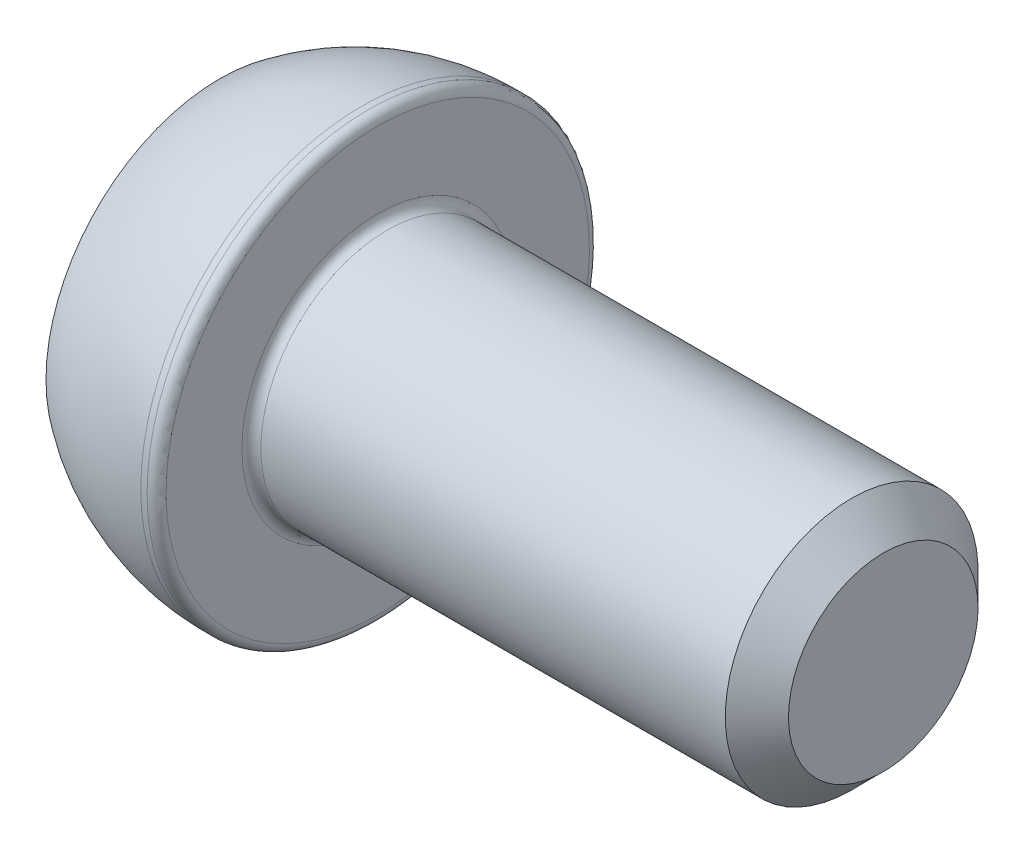
ISO-10303-21;
HEADER;
FILE_DESCRIPTION(('STEP AP214'),'2;1');
FILE_NAME('part.step','',(''),(''),'','','');
FILE_SCHEMA(('AUTOMOTIVE_DESIGN { 1 0 10303 214 1 1 1 1 }'));
ENDSEC;
DATA;
#1=APPLICATION_CONTEXT('core data for automotive mechanical design processes');
#2=APPLICATION_PROTOCOL_DEFINITION('international standard','automotive_design',2000,#1);
#3=PRODUCT_CONTEXT('',#1,'mechanical');
#4=PRODUCT('Part','Part','',(#3));
#5=PRODUCT_RELATED_PRODUCT_CATEGORY('part','',(#4));
#6=PRODUCT_DEFINITION_FORMATION('','',#4);
#7=PRODUCT_DEFINITION_CONTEXT('part definition',#1,'design');
#8=PRODUCT_DEFINITION('design','',#6,#7);
#9=PRODUCT_DEFINITION_SHAPE('','',#8);
#10=(LENGTH_UNIT() NAMED_UNIT(*) SI_UNIT(.MILLI.,.METRE.));
#11=(NAMED_UNIT(*) PLANE_ANGLE_UNIT() SI_UNIT($,.RADIAN.));
#12=(NAMED_UNIT(*) SI_UNIT($,.STERADIAN.) SOLID_ANGLE_UNIT());
#13=UNCERTAINTY_MEASURE_WITH_UNIT(LENGTH_MEASURE(1.E-05),#10,'distance_accuracy_value','');
#14=(GEOMETRIC_REPRESENTATION_CONTEXT(3) GLOBAL_UNCERTAINTY_ASSIGNED_CONTEXT((#13)) GLOBAL_UNIT_ASSIGNED_CONTEXT((#10,
#11,#12)) REPRESENTATION_CONTEXT('',''));
#15=CARTESIAN_POINT('',(0.,0.,0.));
#16=DIRECTION('',(0.,0.,1.));
#17=DIRECTION('',(1.,0.,0.));
#18=AXIS2_PLACEMENT_3D('',#15,#16,#17);
#19=CARTESIAN_POINT('',(0.,0.,0.));
#20=DIRECTION('',(-1.,0.,0.));
#21=DIRECTION('',(0.,-1.,0.));
#22=AXIS2_PLACEMENT_3D('',#19,#20,#21);
#23=PLANE('',#22);
#24=DIRECTION('',(0.,0.866025403784438,-0.5));
#25=VECTOR('',#24,1.);
#26=CARTESIAN_POINT('',(0.,0.,3.46410161513775));
#27=LINE('',#26,#25);
#28=CARTESIAN_POINT('',(0.,0.,3.46410161513775));
#29=VERTEX_POINT('',#28);
#30=CARTESIAN_POINT('',(0.,3.,1.73205080756888));
#31=VERTEX_POINT('',#30);
#32=EDGE_CURVE('E55',#29,#31,#27,.T.);
#33=ORIENTED_EDGE('',*,*,#32,.F.);
#34=DIRECTION('',(0.,0.866025403784438,0.5));
#35=VECTOR('',#34,1.);
#36=CARTESIAN_POINT('',(0.,-3.,1.73205080756888));
#37=LINE('',#36,#35);
#38=CARTESIAN_POINT('',(0.,-3.,1.73205080756888));
#39=VERTEX_POINT('',#38);
#40=EDGE_CURVE('E138',#39,#29,#37,.T.);
#41=ORIENTED_EDGE('',*,*,#40,.F.);
#42=DIRECTION('',(0.,0.,1.));
#43=VECTOR('',#42,1.);
#44=CARTESIAN_POINT('',(0.,-3.,-1.73205080756888));
#45=LINE('',#44,#43);
#46=CARTESIAN_POINT('',(0.,-3.,-1.73205080756888));
#47=VERTEX_POINT('',#46);
#48=EDGE_CURVE('E136',#47,#39,#45,.T.);
#49=ORIENTED_EDGE('',*,*,#48,.F.);
#50=DIRECTION('',(0.,-0.866025403784438,0.5));
#51=VECTOR('',#50,1.);
#52=CARTESIAN_POINT('',(0.,0.,-3.46410161513775));
#53=LINE('',#52,#51);
#54=CARTESIAN_POINT('',(0.,0.,-3.46410161513775));
#55=VERTEX_POINT('',#54);
#56=EDGE_CURVE('E103',#55,#47,#53,.T.);
#57=ORIENTED_EDGE('',*,*,#56,.F.);
#58=DIRECTION('',(0.,-0.866025403784439,-0.5));
#59=VECTOR('',#58,1.);
#60=CARTESIAN_POINT('',(0.,3.,-1.73205080756888));
#61=LINE('',#60,#59);
#62=CARTESIAN_POINT('',(0.,3.,-1.73205080756888));
#63=VERTEX_POINT('',#62);
#64=EDGE_CURVE('E132',#63,#55,#61,.T.);
#65=ORIENTED_EDGE('',*,*,#64,.F.);
#66=DIRECTION('',(0.,0.,-1.));
#67=VECTOR('',#66,1.);
#68=CARTESIAN_POINT('',(0.,3.,1.73205080756888));
#69=LINE('',#68,#67);
#70=EDGE_CURVE('E129',#31,#63,#69,.T.);
#71=ORIENTED_EDGE('',*,*,#70,.F.);
#72=EDGE_LOOP('',(#33,#41,#49,#57,#65,#71));
#73=FACE_BOUND('',#72,.T.);
#74=CARTESIAN_POINT('',(0.,0.,0.));
#75=DIRECTION('',(1.,0.,0.));
#76=DIRECTION('',(0.,1.,0.));
#77=AXIS2_PLACEMENT_3D('',#74,#75,#76);
#78=CIRCLE('',#77,5.5);
#79=CARTESIAN_POINT('',(0.,5.5,0.));
#80=VERTEX_POINT('',#79);
#81=EDGE_CURVE('E150',#80,#80,#78,.T.);
#82=ORIENTED_EDGE('',*,*,#81,.F.);
#83=EDGE_LOOP('',(#82));
#84=FACE_BOUND('',#83,.T.);
#85=ADVANCED_FACE('F39',(#73,#84),#23,.T.);
#86=CARTESIAN_POINT('',(4.5,0.,0.));
#87=DIRECTION('',(1.,0.,0.));
#88=DIRECTION('',(0.,1.,0.));
#89=AXIS2_PLACEMENT_3D('',#86,#87,#88);
#90=DEGENERATE_TOROIDAL_SURFACE('',#89,0.500000000000003,7.5,.F.);
#91=ORIENTED_EDGE('',*,*,#81,.T.);
#92=EDGE_LOOP('',(#91));
#93=FACE_BOUND('',#92,.T.);
#94=CARTESIAN_POINT('',(4.5,0.,0.));
#95=DIRECTION('',(1.,0.,0.));
#96=DIRECTION('',(0.,1.,0.));
#97=AXIS2_PLACEMENT_3D('',#94,#95,#96);
#98=CIRCLE('',#97,7.);
#99=CARTESIAN_POINT('',(4.5,7.,0.));
#100=VERTEX_POINT('',#99);
#101=EDGE_CURVE('E142',#100,#100,#98,.T.);
#102=ORIENTED_EDGE('',*,*,#101,.F.);
#103=EDGE_LOOP('',(#102));
#104=FACE_BOUND('',#103,.T.);
#105=ADVANCED_FACE('F179',(#93,#104),#90,.F.);
#106=CARTESIAN_POINT('',(21.,0.,0.));
#107=DIRECTION('',(1.,0.,0.));
#108=DIRECTION('',(0.,1.,0.));
#109=AXIS2_PLACEMENT_3D('',#106,#107,#108);
#110=CYLINDRICAL_SURFACE('',#109,6.99999999999999);
#111=CARTESIAN_POINT('',(4.7,0.,0.));
#112=DIRECTION('',(1.,0.,0.));
#113=DIRECTION('',(0.,1.,0.));
#114=AXIS2_PLACEMENT_3D('',#111,#112,#113);
#115=CIRCLE('',#114,6.99999999999999);
#116=CARTESIAN_POINT('',(4.7,7.,0.));
#117=VERTEX_POINT('',#116);
#118=EDGE_CURVE('E162',#117,#117,#115,.F.);
#119=ORIENTED_EDGE('',*,*,#118,.T.);
#120=EDGE_LOOP('',(#119));
#121=FACE_BOUND('',#120,.T.);
#122=ORIENTED_EDGE('',*,*,#101,.T.);
#123=EDGE_LOOP('',(#122));
#124=FACE_BOUND('',#123,.T.);
#125=ADVANCED_FACE('F185',(#121,#124),#110,.T.);
#126=CARTESIAN_POINT('',(5.,7.,0.));
#127=DIRECTION('',(1.,0.,0.));
#128=DIRECTION('',(0.,1.,0.));
#129=AXIS2_PLACEMENT_3D('',#126,#127,#128);
#130=PLANE('',#129);
#131=CARTESIAN_POINT('',(5.,0.,0.));
#132=DIRECTION('',(1.,0.,0.));
#133=DIRECTION('',(0.,1.,0.));
#134=AXIS2_PLACEMENT_3D('',#131,#132,#133);
#135=CIRCLE('',#134,4.29999999999999);
#136=CARTESIAN_POINT('',(5.,4.3,0.));
#137=VERTEX_POINT('',#136);
#138=EDGE_CURVE('E159',#137,#137,#135,.F.);
#139=ORIENTED_EDGE('',*,*,#138,.T.);
#140=EDGE_LOOP('',(#139));
#141=FACE_BOUND('',#140,.T.);
#142=CARTESIAN_POINT('',(5.,0.,0.));
#143=DIRECTION('',(1.,0.,0.));
#144=DIRECTION('',(0.,1.,0.));
#145=AXIS2_PLACEMENT_3D('',#142,#143,#144);
#146=CIRCLE('',#145,6.69999999999999);
#147=CARTESIAN_POINT('',(5.,6.7,0.));
#148=VERTEX_POINT('',#147);
#149=EDGE_CURVE('E156',#148,#148,#146,.T.);
#150=ORIENTED_EDGE('',*,*,#149,.T.);
#151=EDGE_LOOP('',(#150));
#152=FACE_BOUND('',#151,.T.);
#153=ADVANCED_FACE('F204',(#141,#152),#130,.T.);
#154=CARTESIAN_POINT('',(21.,0.,0.));
#155=DIRECTION('',(1.,0.,0.));
#156=DIRECTION('',(0.,1.,0.));
#157=AXIS2_PLACEMENT_3D('',#154,#155,#156);
#158=CYLINDRICAL_SURFACE('',#157,3.99999999999999);
#159=CARTESIAN_POINT('',(20.,0.,0.));
#160=DIRECTION('',(1.,0.,0.));
#161=DIRECTION('',(0.,1.,0.));
#162=AXIS2_PLACEMENT_3D('',#159,#160,#161);
#163=CIRCLE('',#162,3.99999999999999);
#164=CARTESIAN_POINT('',(20.,4.,0.));
#165=VERTEX_POINT('',#164);
#166=EDGE_CURVE('E11',#165,#165,#163,.F.);
#167=ORIENTED_EDGE('',*,*,#166,.T.);
#168=EDGE_LOOP('',(#167));
#169=FACE_BOUND('',#168,.T.);
#170=CARTESIAN_POINT('',(5.3,0.,0.));
#171=DIRECTION('',(1.,0.,0.));
#172=DIRECTION('',(0.,1.,0.));
#173=AXIS2_PLACEMENT_3D('',#170,#171,#172);
#174=CIRCLE('',#173,3.99999999999999);
#175=CARTESIAN_POINT('',(5.3,4.,0.));
#176=VERTEX_POINT('',#175);
#177=EDGE_CURVE('E153',#176,#176,#174,.T.);
#178=ORIENTED_EDGE('',*,*,#177,.T.);
#179=EDGE_LOOP('',(#178));
#180=FACE_BOUND('',#179,.T.);
#181=ADVANCED_FACE('F202',(#169,#180),#158,.T.);
#182=CARTESIAN_POINT('',(21.,4.,0.));
#183=DIRECTION('',(1.,0.,0.));
#184=DIRECTION('',(0.,1.,0.));
#185=AXIS2_PLACEMENT_3D('',#182,#183,#184);
#186=PLANE('',#185);
#187=CARTESIAN_POINT('',(21.,0.,0.));
#188=DIRECTION('',(1.,0.,0.));
#189=DIRECTION('',(0.,1.,0.));
#190=AXIS2_PLACEMENT_3D('',#187,#188,#189);
#191=CIRCLE('',#190,3.);
#192=CARTESIAN_POINT('',(21.,3.,0.));
#193=VERTEX_POINT('',#192);
#194=EDGE_CURVE('E48',#193,#193,#191,.T.);
#195=ORIENTED_EDGE('',*,*,#194,.T.);
#196=EDGE_LOOP('',(#195));
#197=FACE_BOUND('',#196,.T.);
#198=ADVANCED_FACE('F167',(#197),#186,.T.);
#199=CARTESIAN_POINT('',(3.,0.,3.46410161513775));
#200=DIRECTION('',(0.,0.5,0.866025403784439));
#201=DIRECTION('',(0.,-0.866025403784439,0.5));
#202=AXIS2_PLACEMENT_3D('',#199,#200,#201);
#203=PLANE('',#202);
#204=ORIENTED_EDGE('',*,*,#32,.T.);
#205=DIRECTION('',(-1.,0.,0.));
#206=VECTOR('',#205,1.);
#207=CARTESIAN_POINT('',(3.,3.,1.73205080756888));
#208=LINE('',#207,#206);
#209=CARTESIAN_POINT('',(3.,3.,1.73205080756888));
#210=VERTEX_POINT('',#209);
#211=EDGE_CURVE('E85',#210,#31,#208,.T.);
#212=ORIENTED_EDGE('',*,*,#211,.F.);
#213=DIRECTION('',(0.,0.866025403784438,-0.5));
#214=VECTOR('',#213,1.);
#215=CARTESIAN_POINT('',(3.,0.,3.46410161513775));
#216=LINE('',#215,#214);
#217=CARTESIAN_POINT('',(3.,0.,3.46410161513775));
#218=VERTEX_POINT('',#217);
#219=EDGE_CURVE('E140',#218,#210,#216,.T.);
#220=ORIENTED_EDGE('',*,*,#219,.F.);
#221=DIRECTION('',(-1.,0.,0.));
#222=VECTOR('',#221,1.);
#223=CARTESIAN_POINT('',(3.,0.,3.46410161513775));
#224=LINE('',#223,#222);
#225=EDGE_CURVE('E63',#218,#29,#224,.T.);
#226=ORIENTED_EDGE('',*,*,#225,.T.);
#227=EDGE_LOOP('',(#204,#212,#220,#226));
#228=FACE_BOUND('',#227,.T.);
#229=ADVANCED_FACE('F211',(#228),#203,.F.);
#230=CARTESIAN_POINT('',(3.,-3.,1.73205080756888));
#231=DIRECTION('',(0.,-0.5,0.866025403784439));
#232=DIRECTION('',(0.,-0.866025403784439,-0.5));
#233=AXIS2_PLACEMENT_3D('',#230,#231,#232);
#234=PLANE('',#233);
#235=ORIENTED_EDGE('',*,*,#40,.T.);
#236=ORIENTED_EDGE('',*,*,#225,.F.);
#237=DIRECTION('',(0.,0.866025403784438,0.5));
#238=VECTOR('',#237,1.);
#239=CARTESIAN_POINT('',(3.,-3.,1.73205080756888));
#240=LINE('',#239,#238);
#241=CARTESIAN_POINT('',(3.,-3.,1.73205080756888));
#242=VERTEX_POINT('',#241);
#243=EDGE_CURVE('E115',#242,#218,#240,.T.);
#244=ORIENTED_EDGE('',*,*,#243,.F.);
#245=DIRECTION('',(-1.,0.,0.));
#246=VECTOR('',#245,1.);
#247=CARTESIAN_POINT('',(3.,-3.,1.73205080756888));
#248=LINE('',#247,#246);
#249=EDGE_CURVE('E107',#242,#39,#248,.T.);
#250=ORIENTED_EDGE('',*,*,#249,.T.);
#251=EDGE_LOOP('',(#235,#236,#244,#250));
#252=FACE_BOUND('',#251,.T.);
#253=ADVANCED_FACE('F270',(#252),#234,.F.);
#254=CARTESIAN_POINT('',(3.,-3.,-1.73205080756888));
#255=DIRECTION('',(0.,-1.,0.));
#256=DIRECTION('',(0.,0.,-1.));
#257=AXIS2_PLACEMENT_3D('',#254,#255,#256);
#258=PLANE('',#257);
#259=ORIENTED_EDGE('',*,*,#48,.T.);
#260=ORIENTED_EDGE('',*,*,#249,.F.);
#261=DIRECTION('',(0.,0.,1.));
#262=VECTOR('',#261,1.);
#263=CARTESIAN_POINT('',(3.,-3.,-1.73205080756888));
#264=LINE('',#263,#262);
#265=CARTESIAN_POINT('',(3.,-3.,-1.73205080756888));
#266=VERTEX_POINT('',#265);
#267=EDGE_CURVE('E111',#266,#242,#264,.T.);
#268=ORIENTED_EDGE('',*,*,#267,.F.);
#269=DIRECTION('',(-1.,0.,0.));
#270=VECTOR('',#269,1.);
#271=CARTESIAN_POINT('',(3.,-3.,-1.73205080756888));
#272=LINE('',#271,#270);
#273=EDGE_CURVE('E96',#266,#47,#272,.T.);
#274=ORIENTED_EDGE('',*,*,#273,.T.);
#275=EDGE_LOOP('',(#259,#260,#268,#274));
#276=FACE_BOUND('',#275,.T.);
#277=ADVANCED_FACE('F112',(#276),#258,.F.);
#278=CARTESIAN_POINT('',(3.,0.,-3.46410161513775));
#279=DIRECTION('',(0.,-0.5,-0.866025403784439));
#280=DIRECTION('',(0.,0.866025403784439,-0.5));
#281=AXIS2_PLACEMENT_3D('',#278,#279,#280);
#282=PLANE('',#281);
#283=ORIENTED_EDGE('',*,*,#56,.T.);
#284=ORIENTED_EDGE('',*,*,#273,.F.);
#285=DIRECTION('',(0.,-0.866025403784438,0.5));
#286=VECTOR('',#285,1.);
#287=CARTESIAN_POINT('',(3.,0.,-3.46410161513775));
#288=LINE('',#287,#286);
#289=CARTESIAN_POINT('',(3.,0.,-3.46410161513775));
#290=VERTEX_POINT('',#289);
#291=EDGE_CURVE('E100',#290,#266,#288,.T.);
#292=ORIENTED_EDGE('',*,*,#291,.F.);
#293=DIRECTION('',(-1.,0.,0.));
#294=VECTOR('',#293,1.);
#295=CARTESIAN_POINT('',(3.,0.,-3.46410161513775));
#296=LINE('',#295,#294);
#297=EDGE_CURVE('E108',#290,#55,#296,.T.);
#298=ORIENTED_EDGE('',*,*,#297,.T.);
#299=EDGE_LOOP('',(#283,#284,#292,#298));
#300=FACE_BOUND('',#299,.T.);
#301=ADVANCED_FACE('F98',(#300),#282,.F.);
#302=CARTESIAN_POINT('',(3.,3.,-1.73205080756888));
#303=DIRECTION('',(0.,0.5,-0.866025403784439));
#304=DIRECTION('',(0.,0.866025403784439,0.5));
#305=AXIS2_PLACEMENT_3D('',#302,#303,#304);
#306=PLANE('',#305);
#307=ORIENTED_EDGE('',*,*,#64,.T.);
#308=ORIENTED_EDGE('',*,*,#297,.F.);
#309=DIRECTION('',(0.,-0.866025403784439,-0.5));
#310=VECTOR('',#309,1.);
#311=CARTESIAN_POINT('',(3.,3.,-1.73205080756888));
#312=LINE('',#311,#310);
#313=CARTESIAN_POINT('',(3.,3.,-1.73205080756888));
#314=VERTEX_POINT('',#313);
#315=EDGE_CURVE('E121',#314,#290,#312,.T.);
#316=ORIENTED_EDGE('',*,*,#315,.F.);
#317=DIRECTION('',(-1.,0.,0.));
#318=VECTOR('',#317,1.);
#319=CARTESIAN_POINT('',(3.,3.,-1.73205080756888));
#320=LINE('',#319,#318);
#321=EDGE_CURVE('E145',#314,#63,#320,.T.);
#322=ORIENTED_EDGE('',*,*,#321,.T.);
#323=EDGE_LOOP('',(#307,#308,#316,#322));
#324=FACE_BOUND('',#323,.T.);
#325=ADVANCED_FACE('F287',(#324),#306,.F.);
#326=CARTESIAN_POINT('',(3.,3.,1.73205080756888));
#327=DIRECTION('',(0.,1.,0.));
#328=DIRECTION('',(0.,0.,1.));
#329=AXIS2_PLACEMENT_3D('',#326,#327,#328);
#330=PLANE('',#329);
#331=ORIENTED_EDGE('',*,*,#70,.T.);
#332=ORIENTED_EDGE('',*,*,#321,.F.);
#333=DIRECTION('',(0.,0.,-1.));
#334=VECTOR('',#333,1.);
#335=CARTESIAN_POINT('',(3.,3.,1.73205080756888));
#336=LINE('',#335,#334);
#337=EDGE_CURVE('E123',#210,#314,#336,.T.);
#338=ORIENTED_EDGE('',*,*,#337,.F.);
#339=ORIENTED_EDGE('',*,*,#211,.T.);
#340=EDGE_LOOP('',(#331,#332,#338,#339));
#341=FACE_BOUND('',#340,.T.);
#342=ADVANCED_FACE('F196',(#341),#330,.F.);
#343=CARTESIAN_POINT('',(3.,0.,0.));
#344=DIRECTION('',(-1.,0.,0.));
#345=DIRECTION('',(0.,0.,1.));
#346=AXIS2_PLACEMENT_3D('',#343,#344,#345);
#347=PLANE('',#346);
#348=ORIENTED_EDGE('',*,*,#219,.T.);
#349=ORIENTED_EDGE('',*,*,#337,.T.);
#350=ORIENTED_EDGE('',*,*,#315,.T.);
#351=ORIENTED_EDGE('',*,*,#291,.T.);
#352=ORIENTED_EDGE('',*,*,#267,.T.);
#353=ORIENTED_EDGE('',*,*,#243,.T.);
#354=EDGE_LOOP('',(#348,#349,#350,#351,#352,#353));
#355=FACE_BOUND('',#354,.T.);
#356=ADVANCED_FACE('F118',(#355),#347,.T.);
#357=CARTESIAN_POINT('',(5.3,0.,0.));
#358=DIRECTION('',(1.,0.,0.));
#359=DIRECTION('',(0.,1.,0.));
#360=AXIS2_PLACEMENT_3D('',#357,#358,#359);
#361=TOROIDAL_SURFACE('',#360,4.29999999999999,0.3);
#362=ORIENTED_EDGE('',*,*,#138,.F.);
#363=EDGE_LOOP('',(#362));
#364=FACE_BOUND('',#363,.T.);
#365=ORIENTED_EDGE('',*,*,#177,.F.);
#366=EDGE_LOOP('',(#365));
#367=FACE_BOUND('',#366,.T.);
#368=ADVANCED_FACE('F175',(#364,#367),#361,.F.);
#369=CARTESIAN_POINT('',(4.7,0.,0.));
#370=DIRECTION('',(1.,0.,0.));
#371=DIRECTION('',(0.,1.,0.));
#372=AXIS2_PLACEMENT_3D('',#369,#370,#371);
#373=TOROIDAL_SURFACE('',#372,6.69999999999999,0.3);
#374=ORIENTED_EDGE('',*,*,#118,.F.);
#375=EDGE_LOOP('',(#374));
#376=FACE_BOUND('',#375,.T.);
#377=ORIENTED_EDGE('',*,*,#149,.F.);
#378=EDGE_LOOP('',(#377));
#379=FACE_BOUND('',#378,.T.);
#380=ADVANCED_FACE('F170',(#376,#379),#373,.T.);
#381=CARTESIAN_POINT('',(21.,0.,0.));
#382=DIRECTION('',(-1.,0.,0.));
#383=DIRECTION('',(0.,-1.,0.));
#384=AXIS2_PLACEMENT_3D('',#381,#382,#383);
#385=CONICAL_SURFACE('',#384,3.,0.785398163397446);
#386=ORIENTED_EDGE('',*,*,#166,.F.);
#387=EDGE_LOOP('',(#386));
#388=FACE_BOUND('',#387,.T.);
#389=ORIENTED_EDGE('',*,*,#194,.F.);
#390=EDGE_LOOP('',(#389));
#391=FACE_BOUND('',#390,.T.);
#392=ADVANCED_FACE('F42',(#388,#391),#385,.T.);
#393=CLOSED_SHELL('',(#85,#105,#125,#153,#181,#198,#229,#253,#277,#301,#325,#342,#356,#368,#380,#392));
#394=MANIFOLD_SOLID_BREP('B2',#393);
#395=ADVANCED_BREP_SHAPE_REPRESENTATION('',(#18,#394),#14);
#396=SHAPE_DEFINITION_REPRESENTATION(#9,#395);
ENDSEC;
END-ISO-10303-21;
